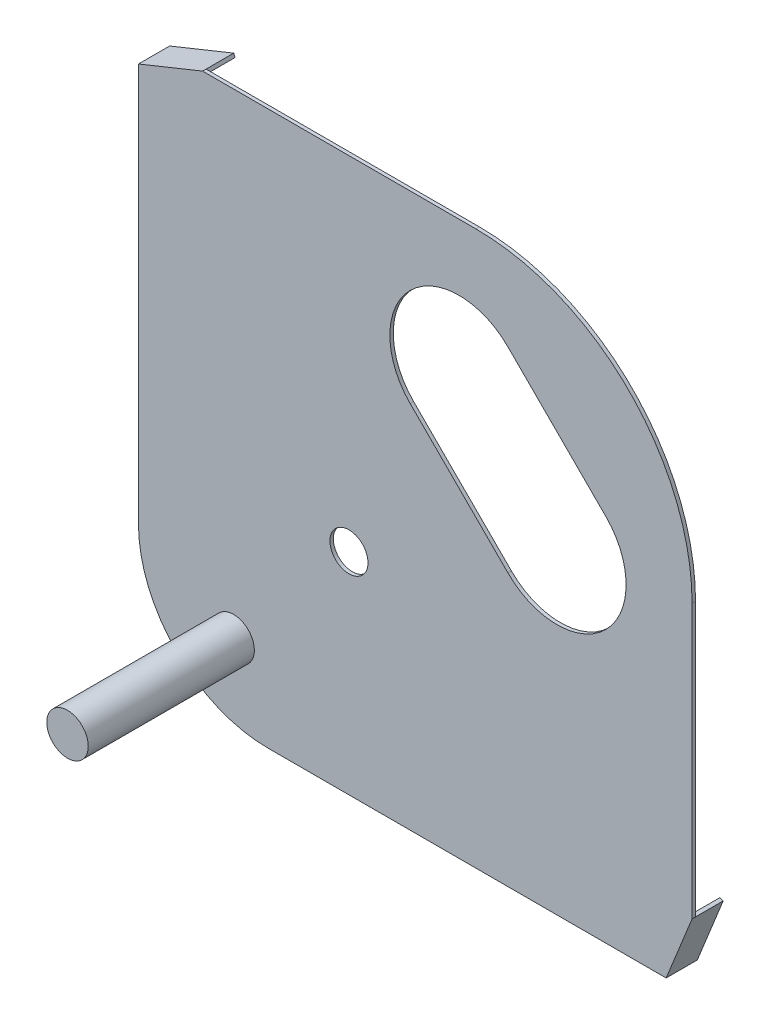
ISO-10303-21;
HEADER;
FILE_DESCRIPTION(('STEP AP214'),'2;1');
FILE_NAME('part.step','',(''),(''),'','','');
FILE_SCHEMA(('AUTOMOTIVE_DESIGN { 1 0 10303 214 1 1 1 1 }'));
ENDSEC;
DATA;
#1=APPLICATION_CONTEXT('core data for automotive mechanical design processes');
#2=APPLICATION_PROTOCOL_DEFINITION('international standard','automotive_design',2000,#1);
#3=PRODUCT_CONTEXT('',#1,'mechanical');
#4=PRODUCT('Part','Part','',(#3));
#5=PRODUCT_RELATED_PRODUCT_CATEGORY('part','',(#4));
#6=PRODUCT_DEFINITION_FORMATION('','',#4);
#7=PRODUCT_DEFINITION_CONTEXT('part definition',#1,'design');
#8=PRODUCT_DEFINITION('design','',#6,#7);
#9=PRODUCT_DEFINITION_SHAPE('','',#8);
#10=(LENGTH_UNIT() NAMED_UNIT(*) SI_UNIT(.MILLI.,.METRE.));
#11=(NAMED_UNIT(*) PLANE_ANGLE_UNIT() SI_UNIT($,.RADIAN.));
#12=(NAMED_UNIT(*) SI_UNIT($,.STERADIAN.) SOLID_ANGLE_UNIT());
#13=UNCERTAINTY_MEASURE_WITH_UNIT(LENGTH_MEASURE(1.E-05),#10,'distance_accuracy_value','');
#14=(GEOMETRIC_REPRESENTATION_CONTEXT(3) GLOBAL_UNCERTAINTY_ASSIGNED_CONTEXT((#13)) GLOBAL_UNIT_ASSIGNED_CONTEXT((#10,
#11,#12)) REPRESENTATION_CONTEXT('',''));
#15=CARTESIAN_POINT('',(0.,0.,0.));
#16=DIRECTION('',(0.,0.,1.));
#17=DIRECTION('',(1.,0.,0.));
#18=AXIS2_PLACEMENT_3D('',#15,#16,#17);
#19=CARTESIAN_POINT('',(0.,0.,-0.254));
#20=DIRECTION('',(0.,0.,1.));
#21=DIRECTION('',(1.,0.,0.));
#22=AXIS2_PLACEMENT_3D('',#19,#20,#21);
#23=PLANE('',#22);
#24=DIRECTION('',(-1.,0.,0.));
#25=VECTOR('',#24,1.);
#26=CARTESIAN_POINT('',(-4.81490601880072,31.115,-0.254));
#27=LINE('',#26,#25);
#28=CARTESIAN_POINT('',(15.24,31.115,-0.254));
#29=VERTEX_POINT('',#28);
#30=CARTESIAN_POINT('',(-4.81490601880072,31.115,-0.254));
#31=VERTEX_POINT('',#30);
#32=EDGE_CURVE('E292',#29,#31,#27,.T.);
#33=ORIENTED_EDGE('',*,*,#32,.F.);
#34=CARTESIAN_POINT('',(15.24,15.24,-0.254));
#35=DIRECTION('',(0.,0.,1.));
#36=DIRECTION('',(1.,0.,0.));
#37=AXIS2_PLACEMENT_3D('',#34,#35,#36);
#38=CIRCLE('',#37,15.875);
#39=CARTESIAN_POINT('',(31.115,15.24,-0.254));
#40=VERTEX_POINT('',#39);
#41=EDGE_CURVE('E289',#40,#29,#38,.T.);
#42=ORIENTED_EDGE('',*,*,#41,.F.);
#43=DIRECTION('',(0.,1.,0.));
#44=VECTOR('',#43,1.);
#45=CARTESIAN_POINT('',(31.115,15.24,-0.254));
#46=LINE('',#45,#44);
#47=CARTESIAN_POINT('',(31.115,-4.81490601880072,-0.254));
#48=VERTEX_POINT('',#47);
#49=EDGE_CURVE('E286',#48,#40,#46,.T.);
#50=ORIENTED_EDGE('',*,*,#49,.F.);
#51=DIRECTION('',(-0.927183854566787,0.374606593415912,0.));
#52=VECTOR('',#51,1.);
#53=CARTESIAN_POINT('',(2.69401367176477,6.66791782190875,-0.254));
#54=LINE('',#53,#52);
#55=CARTESIAN_POINT('',(30.87949530094,-4.71975594407308,-0.254));
#56=VERTEX_POINT('',#55);
#57=EDGE_CURVE('E231',#48,#56,#54,.T.);
#58=ORIENTED_EDGE('',*,*,#57,.T.);
#59=DIRECTION('',(0.374606593415914,0.927183854566787,0.));
#60=VECTOR('',#59,1.);
#61=CARTESIAN_POINT('',(28.1854816291752,-11.3876737659819,-0.254));
#62=LINE('',#61,#60);
#63=CARTESIAN_POINT('',(28.9764938063872,-9.42984992527236,-0.254));
#64=VERTEX_POINT('',#63);
#65=EDGE_CURVE('E240',#64,#56,#62,.T.);
#66=ORIENTED_EDGE('',*,*,#65,.F.);
#67=DIRECTION('',(-0.927183854566787,0.374606593415912,0.));
#68=VECTOR('',#67,1.);
#69=CARTESIAN_POINT('',(0.791012177211938,1.95782384070947,-0.254));
#70=LINE('',#69,#68);
#71=CARTESIAN_POINT('',(29.2119985054472,-9.525,-0.254));
#72=VERTEX_POINT('',#71);
#73=EDGE_CURVE('E242',#72,#64,#70,.T.);
#74=ORIENTED_EDGE('',*,*,#73,.F.);
#75=DIRECTION('',(1.,0.,0.));
#76=VECTOR('',#75,1.);
#77=CARTESIAN_POINT('',(0.,-9.525,-0.254));
#78=LINE('',#77,#76);
#79=CARTESIAN_POINT('',(0.,-9.525,-0.254));
#80=VERTEX_POINT('',#79);
#81=EDGE_CURVE('E301',#80,#72,#78,.T.);
#82=ORIENTED_EDGE('',*,*,#81,.F.);
#83=CARTESIAN_POINT('',(0.,0.,-0.254));
#84=DIRECTION('',(0.,0.,1.));
#85=DIRECTION('',(1.,0.,0.));
#86=AXIS2_PLACEMENT_3D('',#83,#84,#85);
#87=CIRCLE('',#86,9.525);
#88=CARTESIAN_POINT('',(-9.525,0.,-0.254));
#89=VERTEX_POINT('',#88);
#90=EDGE_CURVE('E298',#89,#80,#87,.T.);
#91=ORIENTED_EDGE('',*,*,#90,.F.);
#92=DIRECTION('',(0.,-1.,0.));
#93=VECTOR('',#92,1.);
#94=CARTESIAN_POINT('',(-9.525,0.,-0.254));
#95=LINE('',#94,#93);
#96=CARTESIAN_POINT('',(-9.525,29.2119985054472,-0.254));
#97=VERTEX_POINT('',#96);
#98=EDGE_CURVE('E295',#97,#89,#95,.T.);
#99=ORIENTED_EDGE('',*,*,#98,.F.);
#100=DIRECTION('',(0.374606593415912,-0.927183854566787,0.));
#101=VECTOR('',#100,1.);
#102=CARTESIAN_POINT('',(1.95782384070947,0.791012177211938,-0.254));
#103=LINE('',#102,#101);
#104=CARTESIAN_POINT('',(-9.42984992527236,28.9764938063872,-0.254));
#105=VERTEX_POINT('',#104);
#106=EDGE_CURVE('E182',#97,#105,#103,.T.);
#107=ORIENTED_EDGE('',*,*,#106,.T.);
#108=DIRECTION('',(0.927183854566787,0.374606593415913,0.));
#109=VECTOR('',#108,1.);
#110=CARTESIAN_POINT('',(-11.3876737659818,28.1854816291752,-0.254));
#111=LINE('',#110,#109);
#112=CARTESIAN_POINT('',(-4.71975594407308,30.87949530094,-0.254));
#113=VERTEX_POINT('',#112);
#114=EDGE_CURVE('E211',#105,#113,#111,.T.);
#115=ORIENTED_EDGE('',*,*,#114,.T.);
#116=DIRECTION('',(0.374606593415915,-0.927183854566786,0.));
#117=VECTOR('',#116,1.);
#118=CARTESIAN_POINT('',(6.66791782190883,2.69401367176483,-0.254));
#119=LINE('',#118,#117);
#120=EDGE_CURVE('E214',#31,#113,#119,.T.);
#121=ORIENTED_EDGE('',*,*,#120,.F.);
#122=EDGE_LOOP('',(#33,#42,#50,#58,#66,#74,#82,#91,#99,#107,#115,#121));
#123=FACE_BOUND('',#122,.T.);
#124=CARTESIAN_POINT('',(5.92696903990563,5.92696903990565,-0.254));
#125=DIRECTION('',(0.,0.,1.));
#126=DIRECTION('',(1.,0.,0.));
#127=AXIS2_PLACEMENT_3D('',#124,#125,#126);
#128=CIRCLE('',#127,1.397);
#129=CARTESIAN_POINT('',(7.32396903990563,5.92696903990565,-0.254));
#130=VERTEX_POINT('',#129);
#131=EDGE_CURVE('E280',#130,#130,#128,.T.);
#132=ORIENTED_EDGE('',*,*,#131,.T.);
#133=EDGE_LOOP('',(#132));
#134=FACE_BOUND('',#133,.T.);
#135=CARTESIAN_POINT('',(14.0091995488679,21.1934044457232,-0.254));
#136=DIRECTION('',(0.,0.,1.));
#137=DIRECTION('',(1.,0.,0.));
#138=AXIS2_PLACEMENT_3D('',#135,#136,#137);
#139=CIRCLE('',#138,5.08);
#140=CARTESIAN_POINT('',(17.6013019972955,24.7855068941509,-0.254));
#141=VERTEX_POINT('',#140);
#142=CARTESIAN_POINT('',(10.4170971004402,17.6013019972956,-0.254));
#143=VERTEX_POINT('',#142);
#144=EDGE_CURVE('E260',#141,#143,#139,.T.);
#145=ORIENTED_EDGE('',*,*,#144,.T.);
#146=DIRECTION('',(0.707106781186548,-0.707106781186548,0.));
#147=VECTOR('',#146,1.);
#148=CARTESIAN_POINT('',(10.4170971004402,17.6013019972956,-0.254));
#149=LINE('',#148,#147);
#150=CARTESIAN_POINT('',(17.6013019972955,10.4170971004402,-0.254));
#151=VERTEX_POINT('',#150);
#152=EDGE_CURVE('E251',#143,#151,#149,.T.);
#153=ORIENTED_EDGE('',*,*,#152,.T.);
#154=CARTESIAN_POINT('',(21.1934044457232,14.0091995488679,-0.254));
#155=DIRECTION('',(0.,0.,1.));
#156=DIRECTION('',(1.,0.,0.));
#157=AXIS2_PLACEMENT_3D('',#154,#155,#156);
#158=CIRCLE('',#157,5.08);
#159=CARTESIAN_POINT('',(24.7855068941509,17.6013019972955,-0.254));
#160=VERTEX_POINT('',#159);
#161=EDGE_CURVE('E254',#151,#160,#158,.T.);
#162=ORIENTED_EDGE('',*,*,#161,.T.);
#163=DIRECTION('',(0.707106781186547,-0.707106781186547,0.));
#164=VECTOR('',#163,1.);
#165=CARTESIAN_POINT('',(17.6013019972955,24.7855068941509,-0.254));
#166=LINE('',#165,#164);
#167=EDGE_CURVE('E258',#141,#160,#166,.T.);
#168=ORIENTED_EDGE('',*,*,#167,.F.);
#169=EDGE_LOOP('',(#145,#153,#162,#168));
#170=FACE_BOUND('',#169,.T.);
#171=ADVANCED_FACE('F52',(#123,#134,#170),#23,.F.);
#172=CARTESIAN_POINT('',(31.115,-4.81490601880072,-0.254));
#173=DIRECTION('',(0.927183854566787,-0.374606593415914,0.));
#174=DIRECTION('',(0.374606593415914,0.927183854566787,0.));
#175=AXIS2_PLACEMENT_3D('',#172,#173,#174);
#176=PLANE('',#175);
#177=DIRECTION('',(0.374606593415914,0.927183854566787,0.));
#178=VECTOR('',#177,1.);
#179=CARTESIAN_POINT('',(31.115,-4.81490601880072,0.));
#180=LINE('',#179,#178);
#181=CARTESIAN_POINT('',(29.2119985054472,-9.525,0.));
#182=VERTEX_POINT('',#181);
#183=CARTESIAN_POINT('',(31.115,-4.81490601880072,0.));
#184=VERTEX_POINT('',#183);
#185=EDGE_CURVE('E283',#182,#184,#180,.T.);
#186=ORIENTED_EDGE('',*,*,#185,.F.);
#187=DIRECTION('',(0.,0.,1.));
#188=VECTOR('',#187,1.);
#189=CARTESIAN_POINT('',(29.2119985054472,-9.525,-0.254));
#190=LINE('',#189,#188);
#191=EDGE_CURVE('E13',#72,#182,#190,.T.);
#192=ORIENTED_EDGE('',*,*,#191,.F.);
#193=DIRECTION('',(0.,0.,1.));
#194=VECTOR('',#193,1.);
#195=CARTESIAN_POINT('',(29.2119985054472,-9.525,-2.286));
#196=LINE('',#195,#194);
#197=CARTESIAN_POINT('',(29.2119985054472,-9.525,-2.286));
#198=VERTEX_POINT('',#197);
#199=EDGE_CURVE('E227',#198,#72,#196,.T.);
#200=ORIENTED_EDGE('',*,*,#199,.F.);
#201=DIRECTION('',(0.374606593415914,0.927183854566787,0.));
#202=VECTOR('',#201,1.);
#203=CARTESIAN_POINT('',(28.4209863282352,-11.4828238407095,-2.286));
#204=LINE('',#203,#202);
#205=CARTESIAN_POINT('',(31.115,-4.81490601880072,-2.286));
#206=VERTEX_POINT('',#205);
#207=EDGE_CURVE('E219',#198,#206,#204,.T.);
#208=ORIENTED_EDGE('',*,*,#207,.T.);
#209=DIRECTION('',(0.,0.,1.));
#210=VECTOR('',#209,1.);
#211=CARTESIAN_POINT('',(31.115,-4.81490601880072,-2.286));
#212=LINE('',#211,#210);
#213=EDGE_CURVE('E235',#206,#48,#212,.T.);
#214=ORIENTED_EDGE('',*,*,#213,.T.);
#215=DIRECTION('',(0.,0.,1.));
#216=VECTOR('',#215,1.);
#217=CARTESIAN_POINT('',(31.115,-4.81490601880072,-0.254));
#218=LINE('',#217,#216);
#219=EDGE_CURVE('E56',#48,#184,#218,.T.);
#220=ORIENTED_EDGE('',*,*,#219,.T.);
#221=EDGE_LOOP('',(#186,#192,#200,#208,#214,#220));
#222=FACE_BOUND('',#221,.T.);
#223=ADVANCED_FACE('F54',(#222),#176,.T.);
#224=CARTESIAN_POINT('',(0.,-9.525,-0.254));
#225=DIRECTION('',(0.,-1.,0.));
#226=DIRECTION('',(1.,0.,0.));
#227=AXIS2_PLACEMENT_3D('',#224,#225,#226);
#228=PLANE('',#227);
#229=DIRECTION('',(1.,0.,0.));
#230=VECTOR('',#229,1.);
#231=CARTESIAN_POINT('',(0.,-9.525,0.));
#232=LINE('',#231,#230);
#233=CARTESIAN_POINT('',(0.,-9.525,0.));
#234=VERTEX_POINT('',#233);
#235=EDGE_CURVE('E290',#234,#182,#232,.T.);
#236=ORIENTED_EDGE('',*,*,#235,.F.);
#237=DIRECTION('',(0.,0.,1.));
#238=VECTOR('',#237,1.);
#239=CARTESIAN_POINT('',(0.,-9.525,-0.254));
#240=LINE('',#239,#238);
#241=EDGE_CURVE('E61',#80,#234,#240,.T.);
#242=ORIENTED_EDGE('',*,*,#241,.F.);
#243=ORIENTED_EDGE('',*,*,#81,.T.);
#244=ORIENTED_EDGE('',*,*,#191,.T.);
#245=EDGE_LOOP('',(#236,#242,#243,#244));
#246=FACE_BOUND('',#245,.T.);
#247=ADVANCED_FACE('F351',(#246),#228,.T.);
#248=CARTESIAN_POINT('',(0.,0.,-0.254));
#249=DIRECTION('',(0.,0.,1.));
#250=DIRECTION('',(1.,0.,0.));
#251=AXIS2_PLACEMENT_3D('',#248,#249,#250);
#252=CYLINDRICAL_SURFACE('',#251,9.525);
#253=CARTESIAN_POINT('',(0.,0.,0.));
#254=DIRECTION('',(0.,0.,1.));
#255=DIRECTION('',(1.,0.,0.));
#256=AXIS2_PLACEMENT_3D('',#253,#254,#255);
#257=CIRCLE('',#256,9.525);
#258=CARTESIAN_POINT('',(-9.525,0.,0.));
#259=VERTEX_POINT('',#258);
#260=EDGE_CURVE('E320',#259,#234,#257,.T.);
#261=ORIENTED_EDGE('',*,*,#260,.F.);
#262=DIRECTION('',(0.,0.,1.));
#263=VECTOR('',#262,1.);
#264=CARTESIAN_POINT('',(-9.525,0.,-0.254));
#265=LINE('',#264,#263);
#266=EDGE_CURVE('E326',#89,#259,#265,.T.);
#267=ORIENTED_EDGE('',*,*,#266,.F.);
#268=ORIENTED_EDGE('',*,*,#90,.T.);
#269=ORIENTED_EDGE('',*,*,#241,.T.);
#270=EDGE_LOOP('',(#261,#267,#268,#269));
#271=FACE_BOUND('',#270,.T.);
#272=ADVANCED_FACE('F383',(#271),#252,.T.);
#273=CARTESIAN_POINT('',(-9.525,0.,-0.254));
#274=DIRECTION('',(-1.,0.,0.));
#275=DIRECTION('',(0.,-1.,0.));
#276=AXIS2_PLACEMENT_3D('',#273,#274,#275);
#277=PLANE('',#276);
#278=DIRECTION('',(0.,-1.,0.));
#279=VECTOR('',#278,1.);
#280=CARTESIAN_POINT('',(-9.525,0.,0.));
#281=LINE('',#280,#279);
#282=CARTESIAN_POINT('',(-9.525,29.2119985054472,0.));
#283=VERTEX_POINT('',#282);
#284=EDGE_CURVE('E317',#283,#259,#281,.T.);
#285=ORIENTED_EDGE('',*,*,#284,.F.);
#286=DIRECTION('',(0.,0.,1.));
#287=VECTOR('',#286,1.);
#288=CARTESIAN_POINT('',(-9.525,29.2119985054472,-0.254));
#289=LINE('',#288,#287);
#290=EDGE_CURVE('E328',#97,#283,#289,.T.);
#291=ORIENTED_EDGE('',*,*,#290,.F.);
#292=ORIENTED_EDGE('',*,*,#98,.T.);
#293=ORIENTED_EDGE('',*,*,#266,.T.);
#294=EDGE_LOOP('',(#285,#291,#292,#293));
#295=FACE_BOUND('',#294,.T.);
#296=ADVANCED_FACE('F380',(#295),#277,.T.);
#297=CARTESIAN_POINT('',(-9.525,29.2119985054472,-0.254));
#298=DIRECTION('',(-0.374606593415913,0.927183854566787,0.));
#299=DIRECTION('',(-0.927183854566787,-0.374606593415913,0.));
#300=AXIS2_PLACEMENT_3D('',#297,#298,#299);
#301=PLANE('',#300);
#302=DIRECTION('',(-0.927183854566787,-0.374606593415913,0.));
#303=VECTOR('',#302,1.);
#304=CARTESIAN_POINT('',(-9.525,29.2119985054472,0.));
#305=LINE('',#304,#303);
#306=CARTESIAN_POINT('',(-4.81490601880072,31.115,0.));
#307=VERTEX_POINT('',#306);
#308=EDGE_CURVE('E314',#307,#283,#305,.T.);
#309=ORIENTED_EDGE('',*,*,#308,.F.);
#310=DIRECTION('',(0.,0.,1.));
#311=VECTOR('',#310,1.);
#312=CARTESIAN_POINT('',(-4.81490601880072,31.115,-0.254));
#313=LINE('',#312,#311);
#314=EDGE_CURVE('E330',#31,#307,#313,.T.);
#315=ORIENTED_EDGE('',*,*,#314,.F.);
#316=DIRECTION('',(0.,0.,1.));
#317=VECTOR('',#316,1.);
#318=CARTESIAN_POINT('',(-4.81490601880072,31.115,-2.286));
#319=LINE('',#318,#317);
#320=CARTESIAN_POINT('',(-4.81490601880072,31.115,-2.286));
#321=VERTEX_POINT('',#320);
#322=EDGE_CURVE('E199',#321,#31,#319,.T.);
#323=ORIENTED_EDGE('',*,*,#322,.F.);
#324=DIRECTION('',(-0.927183854566787,-0.374606593415913,0.));
#325=VECTOR('',#324,1.);
#326=CARTESIAN_POINT('',(-11.4828238407095,28.4209863282352,-2.286));
#327=LINE('',#326,#325);
#328=CARTESIAN_POINT('',(-9.525,29.2119985054472,-2.286));
#329=VERTEX_POINT('',#328);
#330=EDGE_CURVE('E192',#321,#329,#327,.T.);
#331=ORIENTED_EDGE('',*,*,#330,.T.);
#332=DIRECTION('',(0.,0.,1.));
#333=VECTOR('',#332,1.);
#334=CARTESIAN_POINT('',(-9.525,29.2119985054472,-2.286));
#335=LINE('',#334,#333);
#336=EDGE_CURVE('E177',#329,#97,#335,.T.);
#337=ORIENTED_EDGE('',*,*,#336,.T.);
#338=ORIENTED_EDGE('',*,*,#290,.T.);
#339=EDGE_LOOP('',(#309,#315,#323,#331,#337,#338));
#340=FACE_BOUND('',#339,.T.);
#341=ADVANCED_FACE('F197',(#340),#301,.T.);
#342=CARTESIAN_POINT('',(-4.81490601880072,31.115,-0.254));
#343=DIRECTION('',(0.,1.,0.));
#344=DIRECTION('',(0.,0.,1.));
#345=AXIS2_PLACEMENT_3D('',#342,#343,#344);
#346=PLANE('',#345);
#347=DIRECTION('',(-1.,0.,0.));
#348=VECTOR('',#347,1.);
#349=CARTESIAN_POINT('',(-4.81490601880072,31.115,0.));
#350=LINE('',#349,#348);
#351=CARTESIAN_POINT('',(15.24,31.115,0.));
#352=VERTEX_POINT('',#351);
#353=EDGE_CURVE('E311',#352,#307,#350,.T.);
#354=ORIENTED_EDGE('',*,*,#353,.F.);
#355=DIRECTION('',(0.,0.,1.));
#356=VECTOR('',#355,1.);
#357=CARTESIAN_POINT('',(15.24,31.115,-0.254));
#358=LINE('',#357,#356);
#359=EDGE_CURVE('E332',#29,#352,#358,.T.);
#360=ORIENTED_EDGE('',*,*,#359,.F.);
#361=ORIENTED_EDGE('',*,*,#32,.T.);
#362=ORIENTED_EDGE('',*,*,#314,.T.);
#363=EDGE_LOOP('',(#354,#360,#361,#362));
#364=FACE_BOUND('',#363,.T.);
#365=ADVANCED_FACE('F376',(#364),#346,.T.);
#366=CARTESIAN_POINT('',(15.24,15.24,-0.254));
#367=DIRECTION('',(0.,0.,1.));
#368=DIRECTION('',(1.,0.,0.));
#369=AXIS2_PLACEMENT_3D('',#366,#367,#368);
#370=CYLINDRICAL_SURFACE('',#369,15.875);
#371=ORIENTED_EDGE('',*,*,#41,.T.);
#372=ORIENTED_EDGE('',*,*,#359,.T.);
#373=CARTESIAN_POINT('',(15.24,15.24,0.));
#374=DIRECTION('',(0.,0.,1.));
#375=DIRECTION('',(1.,0.,0.));
#376=AXIS2_PLACEMENT_3D('',#373,#374,#375);
#377=CIRCLE('',#376,15.875);
#378=CARTESIAN_POINT('',(31.115,15.24,0.));
#379=VERTEX_POINT('',#378);
#380=EDGE_CURVE('E309',#379,#352,#377,.T.);
#381=ORIENTED_EDGE('',*,*,#380,.F.);
#382=DIRECTION('',(0.,0.,1.));
#383=VECTOR('',#382,1.);
#384=CARTESIAN_POINT('',(31.115,15.24,-0.254));
#385=LINE('',#384,#383);
#386=EDGE_CURVE('E334',#40,#379,#385,.T.);
#387=ORIENTED_EDGE('',*,*,#386,.F.);
#388=EDGE_LOOP('',(#371,#372,#381,#387));
#389=FACE_BOUND('',#388,.T.);
#390=ADVANCED_FACE('F373',(#389),#370,.T.);
#391=CARTESIAN_POINT('',(31.115,15.24,-0.254));
#392=DIRECTION('',(1.,0.,0.));
#393=DIRECTION('',(0.,1.,0.));
#394=AXIS2_PLACEMENT_3D('',#391,#392,#393);
#395=PLANE('',#394);
#396=DIRECTION('',(0.,1.,0.));
#397=VECTOR('',#396,1.);
#398=CARTESIAN_POINT('',(31.115,15.24,0.));
#399=LINE('',#398,#397);
#400=EDGE_CURVE('E306',#184,#379,#399,.T.);
#401=ORIENTED_EDGE('',*,*,#400,.F.);
#402=ORIENTED_EDGE('',*,*,#219,.F.);
#403=ORIENTED_EDGE('',*,*,#49,.T.);
#404=ORIENTED_EDGE('',*,*,#386,.T.);
#405=EDGE_LOOP('',(#401,#402,#403,#404));
#406=FACE_BOUND('',#405,.T.);
#407=ADVANCED_FACE('F344',(#406),#395,.T.);
#408=CARTESIAN_POINT('',(0.,0.,0.));
#409=DIRECTION('',(0.,0.,1.));
#410=DIRECTION('',(1.,0.,0.));
#411=AXIS2_PLACEMENT_3D('',#408,#409,#410);
#412=PLANE('',#411);
#413=ORIENTED_EDGE('',*,*,#353,.T.);
#414=ORIENTED_EDGE('',*,*,#308,.T.);
#415=ORIENTED_EDGE('',*,*,#284,.T.);
#416=ORIENTED_EDGE('',*,*,#260,.T.);
#417=ORIENTED_EDGE('',*,*,#235,.T.);
#418=ORIENTED_EDGE('',*,*,#185,.T.);
#419=ORIENTED_EDGE('',*,*,#400,.T.);
#420=ORIENTED_EDGE('',*,*,#380,.T.);
#421=EDGE_LOOP('',(#413,#414,#415,#416,#417,#418,#419,#420));
#422=FACE_BOUND('',#421,.T.);
#423=CARTESIAN_POINT('',(-2.54,-3.81,0.));
#424=DIRECTION('',(0.,0.,1.));
#425=DIRECTION('',(1.,0.,0.));
#426=AXIS2_PLACEMENT_3D('',#423,#424,#425);
#427=CIRCLE('',#426,1.524);
#428=CARTESIAN_POINT('',(-1.016,-3.81,0.));
#429=VERTEX_POINT('',#428);
#430=EDGE_CURVE('E244',#429,#429,#427,.T.);
#431=ORIENTED_EDGE('',*,*,#430,.F.);
#432=EDGE_LOOP('',(#431));
#433=FACE_BOUND('',#432,.T.);
#434=DIRECTION('',(0.707106781186548,-0.707106781186548,0.));
#435=VECTOR('',#434,1.);
#436=CARTESIAN_POINT('',(10.4170971004402,17.6013019972956,0.));
#437=LINE('',#436,#435);
#438=CARTESIAN_POINT('',(10.4170971004402,17.6013019972956,0.));
#439=VERTEX_POINT('',#438);
#440=CARTESIAN_POINT('',(17.6013019972955,10.4170971004402,0.));
#441=VERTEX_POINT('',#440);
#442=EDGE_CURVE('E248',#439,#441,#437,.T.);
#443=ORIENTED_EDGE('',*,*,#442,.F.);
#444=CARTESIAN_POINT('',(14.0091995488679,21.1934044457232,0.));
#445=DIRECTION('',(0.,0.,1.));
#446=DIRECTION('',(1.,0.,0.));
#447=AXIS2_PLACEMENT_3D('',#444,#445,#446);
#448=CIRCLE('',#447,5.08);
#449=CARTESIAN_POINT('',(17.6013019972955,24.7855068941509,0.));
#450=VERTEX_POINT('',#449);
#451=EDGE_CURVE('E255',#450,#439,#448,.T.);
#452=ORIENTED_EDGE('',*,*,#451,.F.);
#453=DIRECTION('',(0.707106781186547,-0.707106781186547,0.));
#454=VECTOR('',#453,1.);
#455=CARTESIAN_POINT('',(17.6013019972955,24.7855068941509,0.));
#456=LINE('',#455,#454);
#457=CARTESIAN_POINT('',(24.7855068941509,17.6013019972955,0.));
#458=VERTEX_POINT('',#457);
#459=EDGE_CURVE('E267',#450,#458,#456,.T.);
#460=ORIENTED_EDGE('',*,*,#459,.T.);
#461=CARTESIAN_POINT('',(21.1934044457232,14.0091995488679,0.));
#462=DIRECTION('',(0.,0.,1.));
#463=DIRECTION('',(1.,0.,0.));
#464=AXIS2_PLACEMENT_3D('',#461,#462,#463);
#465=CIRCLE('',#464,5.08);
#466=EDGE_CURVE('E265',#441,#458,#465,.T.);
#467=ORIENTED_EDGE('',*,*,#466,.F.);
#468=EDGE_LOOP('',(#443,#452,#460,#467));
#469=FACE_BOUND('',#468,.T.);
#470=CARTESIAN_POINT('',(5.92696903990563,5.92696903990565,0.));
#471=DIRECTION('',(0.,0.,1.));
#472=DIRECTION('',(1.,0.,0.));
#473=AXIS2_PLACEMENT_3D('',#470,#471,#472);
#474=CIRCLE('',#473,1.397);
#475=CARTESIAN_POINT('',(7.32396903990563,5.92696903990565,0.));
#476=VERTEX_POINT('',#475);
#477=EDGE_CURVE('E274',#476,#476,#474,.T.);
#478=ORIENTED_EDGE('',*,*,#477,.F.);
#479=EDGE_LOOP('',(#478));
#480=FACE_BOUND('',#479,.T.);
#481=ADVANCED_FACE('F346',(#422,#433,#469,#480),#412,.T.);
#482=CARTESIAN_POINT('',(5.92696903990563,5.92696903990565,-0.254));
#483=DIRECTION('',(0.,0.,1.));
#484=DIRECTION('',(1.,0.,0.));
#485=AXIS2_PLACEMENT_3D('',#482,#483,#484);
#486=CYLINDRICAL_SURFACE('',#485,1.397);
#487=ORIENTED_EDGE('',*,*,#131,.F.);
#488=EDGE_LOOP('',(#487));
#489=FACE_BOUND('',#488,.T.);
#490=ORIENTED_EDGE('',*,*,#477,.T.);
#491=EDGE_LOOP('',(#490));
#492=FACE_BOUND('',#491,.T.);
#493=ADVANCED_FACE('F403',(#489,#492),#486,.F.);
#494=CARTESIAN_POINT('',(10.4170971004402,17.6013019972956,-0.254));
#495=DIRECTION('',(-0.707106781186548,-0.707106781186548,0.));
#496=DIRECTION('',(0.707106781186548,-0.707106781186548,0.));
#497=AXIS2_PLACEMENT_3D('',#494,#495,#496);
#498=PLANE('',#497);
#499=ORIENTED_EDGE('',*,*,#442,.T.);
#500=DIRECTION('',(0.,0.,1.));
#501=VECTOR('',#500,1.);
#502=CARTESIAN_POINT('',(17.6013019972955,10.4170971004402,-0.254));
#503=LINE('',#502,#501);
#504=EDGE_CURVE('E263',#151,#441,#503,.T.);
#505=ORIENTED_EDGE('',*,*,#504,.F.);
#506=ORIENTED_EDGE('',*,*,#152,.F.);
#507=DIRECTION('',(0.,0.,1.));
#508=VECTOR('',#507,1.);
#509=CARTESIAN_POINT('',(10.4170971004402,17.6013019972956,-0.254));
#510=LINE('',#509,#508);
#511=EDGE_CURVE('E272',#143,#439,#510,.T.);
#512=ORIENTED_EDGE('',*,*,#511,.T.);
#513=EDGE_LOOP('',(#499,#505,#506,#512));
#514=FACE_BOUND('',#513,.T.);
#515=ADVANCED_FACE('F436',(#514),#498,.F.);
#516=CARTESIAN_POINT('',(14.0091995488679,21.1934044457232,-0.254));
#517=DIRECTION('',(0.,0.,1.));
#518=DIRECTION('',(1.,0.,0.));
#519=AXIS2_PLACEMENT_3D('',#516,#517,#518);
#520=CYLINDRICAL_SURFACE('',#519,5.08);
#521=ORIENTED_EDGE('',*,*,#451,.T.);
#522=ORIENTED_EDGE('',*,*,#511,.F.);
#523=ORIENTED_EDGE('',*,*,#144,.F.);
#524=DIRECTION('',(0.,0.,1.));
#525=VECTOR('',#524,1.);
#526=CARTESIAN_POINT('',(17.6013019972955,24.7855068941509,-0.254));
#527=LINE('',#526,#525);
#528=EDGE_CURVE('E275',#141,#450,#527,.T.);
#529=ORIENTED_EDGE('',*,*,#528,.T.);
#530=EDGE_LOOP('',(#521,#522,#523,#529));
#531=FACE_BOUND('',#530,.T.);
#532=ADVANCED_FACE('F444',(#531),#520,.F.);
#533=CARTESIAN_POINT('',(17.6013019972955,24.7855068941509,-0.254));
#534=DIRECTION('',(-0.707106781186548,-0.707106781186548,0.));
#535=DIRECTION('',(0.707106781186548,-0.707106781186548,0.));
#536=AXIS2_PLACEMENT_3D('',#533,#534,#535);
#537=PLANE('',#536);
#538=ORIENTED_EDGE('',*,*,#459,.F.);
#539=ORIENTED_EDGE('',*,*,#528,.F.);
#540=ORIENTED_EDGE('',*,*,#167,.T.);
#541=DIRECTION('',(0.,0.,1.));
#542=VECTOR('',#541,1.);
#543=CARTESIAN_POINT('',(24.7855068941509,17.6013019972955,-0.254));
#544=LINE('',#543,#542);
#545=EDGE_CURVE('E77',#160,#458,#544,.T.);
#546=ORIENTED_EDGE('',*,*,#545,.T.);
#547=EDGE_LOOP('',(#538,#539,#540,#546));
#548=FACE_BOUND('',#547,.T.);
#549=ADVANCED_FACE('F451',(#548),#537,.T.);
#550=CARTESIAN_POINT('',(21.1934044457232,14.0091995488679,-0.254));
#551=DIRECTION('',(0.,0.,1.));
#552=DIRECTION('',(1.,0.,0.));
#553=AXIS2_PLACEMENT_3D('',#550,#551,#552);
#554=CYLINDRICAL_SURFACE('',#553,5.08);
#555=ORIENTED_EDGE('',*,*,#466,.T.);
#556=ORIENTED_EDGE('',*,*,#545,.F.);
#557=ORIENTED_EDGE('',*,*,#161,.F.);
#558=ORIENTED_EDGE('',*,*,#504,.T.);
#559=EDGE_LOOP('',(#555,#556,#557,#558));
#560=FACE_BOUND('',#559,.T.);
#561=ADVANCED_FACE('F459',(#560),#554,.F.);
#562=CARTESIAN_POINT('',(-2.54,-3.81,12.192));
#563=DIRECTION('',(0.,0.,-1.));
#564=DIRECTION('',(-1.,0.,0.));
#565=AXIS2_PLACEMENT_3D('',#562,#563,#564);
#566=CYLINDRICAL_SURFACE('',#565,1.524);
#567=CARTESIAN_POINT('',(-2.54,-3.81,12.192));
#568=DIRECTION('',(0.,0.,1.));
#569=DIRECTION('',(1.,0.,0.));
#570=AXIS2_PLACEMENT_3D('',#567,#568,#569);
#571=CIRCLE('',#570,1.524);
#572=CARTESIAN_POINT('',(-1.016,-3.81,12.192));
#573=VERTEX_POINT('',#572);
#574=EDGE_CURVE('E245',#573,#573,#571,.T.);
#575=ORIENTED_EDGE('',*,*,#574,.F.);
#576=EDGE_LOOP('',(#575));
#577=FACE_BOUND('',#576,.T.);
#578=ORIENTED_EDGE('',*,*,#430,.T.);
#579=EDGE_LOOP('',(#578));
#580=FACE_BOUND('',#579,.T.);
#581=ADVANCED_FACE('F467',(#577,#580),#566,.T.);
#582=CARTESIAN_POINT('',(0.,0.,12.192));
#583=DIRECTION('',(0.,0.,1.));
#584=DIRECTION('',(1.,0.,0.));
#585=AXIS2_PLACEMENT_3D('',#582,#583,#584);
#586=PLANE('',#585);
#587=ORIENTED_EDGE('',*,*,#574,.T.);
#588=EDGE_LOOP('',(#587));
#589=FACE_BOUND('',#588,.T.);
#590=ADVANCED_FACE('F393',(#589),#586,.T.);
#591=CARTESIAN_POINT('',(0.791012177211938,1.95782384070947,-2.286));
#592=DIRECTION('',(0.374606593415912,0.927183854566787,0.));
#593=DIRECTION('',(-0.927183854566787,0.374606593415912,0.));
#594=AXIS2_PLACEMENT_3D('',#591,#592,#593);
#595=PLANE('',#594);
#596=ORIENTED_EDGE('',*,*,#199,.T.);
#597=ORIENTED_EDGE('',*,*,#73,.T.);
#598=DIRECTION('',(0.,0.,1.));
#599=VECTOR('',#598,1.);
#600=CARTESIAN_POINT('',(28.9764938063872,-9.42984992527236,-2.286));
#601=LINE('',#600,#599);
#602=CARTESIAN_POINT('',(28.9764938063872,-9.42984992527236,-2.286));
#603=VERTEX_POINT('',#602);
#604=EDGE_CURVE('E228',#603,#64,#601,.T.);
#605=ORIENTED_EDGE('',*,*,#604,.F.);
#606=DIRECTION('',(-0.927183854566787,0.374606593415912,0.));
#607=VECTOR('',#606,1.);
#608=CARTESIAN_POINT('',(0.791012177211938,1.95782384070947,-2.286));
#609=LINE('',#608,#607);
#610=EDGE_CURVE('E216',#198,#603,#609,.T.);
#611=ORIENTED_EDGE('',*,*,#610,.F.);
#612=EDGE_LOOP('',(#596,#597,#605,#611));
#613=FACE_BOUND('',#612,.T.);
#614=ADVANCED_FACE('F358',(#613),#595,.F.);
#615=CARTESIAN_POINT('',(28.1854816291752,-11.3876737659819,-2.286));
#616=DIRECTION('',(0.927183854566787,-0.374606593415914,0.));
#617=DIRECTION('',(0.374606593415914,0.927183854566787,0.));
#618=AXIS2_PLACEMENT_3D('',#615,#616,#617);
#619=PLANE('',#618);
#620=ORIENTED_EDGE('',*,*,#604,.T.);
#621=ORIENTED_EDGE('',*,*,#65,.T.);
#622=DIRECTION('',(0.,0.,1.));
#623=VECTOR('',#622,1.);
#624=CARTESIAN_POINT('',(30.87949530094,-4.71975594407308,-2.286));
#625=LINE('',#624,#623);
#626=CARTESIAN_POINT('',(30.87949530094,-4.71975594407308,-2.286));
#627=VERTEX_POINT('',#626);
#628=EDGE_CURVE('E232',#627,#56,#625,.T.);
#629=ORIENTED_EDGE('',*,*,#628,.F.);
#630=DIRECTION('',(0.374606593415914,0.927183854566787,0.));
#631=VECTOR('',#630,1.);
#632=CARTESIAN_POINT('',(28.1854816291752,-11.3876737659819,-2.286));
#633=LINE('',#632,#631);
#634=EDGE_CURVE('E225',#603,#627,#633,.T.);
#635=ORIENTED_EDGE('',*,*,#634,.F.);
#636=EDGE_LOOP('',(#620,#621,#629,#635));
#637=FACE_BOUND('',#636,.T.);
#638=ADVANCED_FACE('F385',(#637),#619,.F.);
#639=CARTESIAN_POINT('',(2.69401367176477,6.66791782190875,-2.286));
#640=DIRECTION('',(0.374606593415912,0.927183854566787,0.));
#641=DIRECTION('',(-0.927183854566787,0.374606593415912,0.));
#642=AXIS2_PLACEMENT_3D('',#639,#640,#641);
#643=PLANE('',#642);
#644=ORIENTED_EDGE('',*,*,#57,.F.);
#645=ORIENTED_EDGE('',*,*,#213,.F.);
#646=DIRECTION('',(-0.927183854566787,0.374606593415912,0.));
#647=VECTOR('',#646,1.);
#648=CARTESIAN_POINT('',(2.69401367176477,6.66791782190875,-2.286));
#649=LINE('',#648,#647);
#650=EDGE_CURVE('E222',#206,#627,#649,.T.);
#651=ORIENTED_EDGE('',*,*,#650,.T.);
#652=ORIENTED_EDGE('',*,*,#628,.T.);
#653=EDGE_LOOP('',(#644,#645,#651,#652));
#654=FACE_BOUND('',#653,.T.);
#655=ADVANCED_FACE('F364',(#654),#643,.T.);
#656=CARTESIAN_POINT('',(0.,0.,-2.286));
#657=DIRECTION('',(0.,0.,1.));
#658=DIRECTION('',(1.,0.,0.));
#659=AXIS2_PLACEMENT_3D('',#656,#657,#658);
#660=PLANE('',#659);
#661=ORIENTED_EDGE('',*,*,#610,.T.);
#662=ORIENTED_EDGE('',*,*,#634,.T.);
#663=ORIENTED_EDGE('',*,*,#650,.F.);
#664=ORIENTED_EDGE('',*,*,#207,.F.);
#665=EDGE_LOOP('',(#661,#662,#663,#664));
#666=FACE_BOUND('',#665,.T.);
#667=ADVANCED_FACE('F361',(#666),#660,.F.);
#668=CARTESIAN_POINT('',(6.66791782190883,2.69401367176483,-2.286));
#669=DIRECTION('',(-0.927183854566786,-0.374606593415915,0.));
#670=DIRECTION('',(0.374606593415915,-0.927183854566786,0.));
#671=AXIS2_PLACEMENT_3D('',#668,#669,#670);
#672=PLANE('',#671);
#673=ORIENTED_EDGE('',*,*,#322,.T.);
#674=ORIENTED_EDGE('',*,*,#120,.T.);
#675=DIRECTION('',(0.,0.,1.));
#676=VECTOR('',#675,1.);
#677=CARTESIAN_POINT('',(-4.71975594407308,30.87949530094,-2.286));
#678=LINE('',#677,#676);
#679=CARTESIAN_POINT('',(-4.71975594407308,30.87949530094,-2.286));
#680=VERTEX_POINT('',#679);
#681=EDGE_CURVE('E206',#680,#113,#678,.T.);
#682=ORIENTED_EDGE('',*,*,#681,.F.);
#683=DIRECTION('',(0.374606593415915,-0.927183854566786,0.));
#684=VECTOR('',#683,1.);
#685=CARTESIAN_POINT('',(6.66791782190883,2.69401367176483,-2.286));
#686=LINE('',#685,#684);
#687=EDGE_CURVE('E186',#321,#680,#686,.T.);
#688=ORIENTED_EDGE('',*,*,#687,.F.);
#689=EDGE_LOOP('',(#673,#674,#682,#688));
#690=FACE_BOUND('',#689,.T.);
#691=ADVANCED_FACE('F509',(#690),#672,.F.);
#692=CARTESIAN_POINT('',(-11.3876737659818,28.1854816291752,-2.286));
#693=DIRECTION('',(0.374606593415913,-0.927183854566787,0.));
#694=DIRECTION('',(0.927183854566787,0.374606593415913,0.));
#695=AXIS2_PLACEMENT_3D('',#692,#693,#694);
#696=PLANE('',#695);
#697=ORIENTED_EDGE('',*,*,#114,.F.);
#698=DIRECTION('',(0.,0.,1.));
#699=VECTOR('',#698,1.);
#700=CARTESIAN_POINT('',(-9.42984992527236,28.9764938063872,-2.286));
#701=LINE('',#700,#699);
#702=CARTESIAN_POINT('',(-9.42984992527236,28.9764938063872,-2.286));
#703=VERTEX_POINT('',#702);
#704=EDGE_CURVE('E69',#703,#105,#701,.T.);
#705=ORIENTED_EDGE('',*,*,#704,.F.);
#706=DIRECTION('',(0.927183854566787,0.374606593415913,0.));
#707=VECTOR('',#706,1.);
#708=CARTESIAN_POINT('',(-11.3876737659818,28.1854816291752,-2.286));
#709=LINE('',#708,#707);
#710=EDGE_CURVE('E194',#703,#680,#709,.T.);
#711=ORIENTED_EDGE('',*,*,#710,.T.);
#712=ORIENTED_EDGE('',*,*,#681,.T.);
#713=EDGE_LOOP('',(#697,#705,#711,#712));
#714=FACE_BOUND('',#713,.T.);
#715=ADVANCED_FACE('F518',(#714),#696,.T.);
#716=CARTESIAN_POINT('',(1.95782384070947,0.791012177211938,-2.286));
#717=DIRECTION('',(-0.927183854566787,-0.374606593415912,0.));
#718=DIRECTION('',(0.374606593415912,-0.927183854566787,0.));
#719=AXIS2_PLACEMENT_3D('',#716,#717,#718);
#720=PLANE('',#719);
#721=ORIENTED_EDGE('',*,*,#106,.F.);
#722=ORIENTED_EDGE('',*,*,#336,.F.);
#723=DIRECTION('',(0.374606593415912,-0.927183854566787,0.));
#724=VECTOR('',#723,1.);
#725=CARTESIAN_POINT('',(1.95782384070947,0.791012177211938,-2.286));
#726=LINE('',#725,#724);
#727=EDGE_CURVE('E180',#329,#703,#726,.T.);
#728=ORIENTED_EDGE('',*,*,#727,.T.);
#729=ORIENTED_EDGE('',*,*,#704,.T.);
#730=EDGE_LOOP('',(#721,#722,#728,#729));
#731=FACE_BOUND('',#730,.T.);
#732=ADVANCED_FACE('F179',(#731),#720,.T.);
#733=CARTESIAN_POINT('',(0.,0.,-2.286));
#734=DIRECTION('',(0.,0.,1.));
#735=DIRECTION('',(1.,0.,0.));
#736=AXIS2_PLACEMENT_3D('',#733,#734,#735);
#737=PLANE('',#736);
#738=ORIENTED_EDGE('',*,*,#330,.F.);
#739=ORIENTED_EDGE('',*,*,#687,.T.);
#740=ORIENTED_EDGE('',*,*,#710,.F.);
#741=ORIENTED_EDGE('',*,*,#727,.F.);
#742=EDGE_LOOP('',(#738,#739,#740,#741));
#743=FACE_BOUND('',#742,.T.);
#744=ADVANCED_FACE('F191',(#743),#737,.F.);
#745=CLOSED_SHELL('',(#171,#223,#247,#272,#296,#341,#365,#390,#407,#481,#493,#515,#532,#549,
#561,#581,#590,#614,#638,#655,#667,#691,#715,#732,#744));
#746=MANIFOLD_SOLID_BREP('B2',#745);
#747=ADVANCED_BREP_SHAPE_REPRESENTATION('',(#18,#746),#14);
#748=SHAPE_DEFINITION_REPRESENTATION(#9,#747);
ENDSEC;
END-ISO-10303-21;
